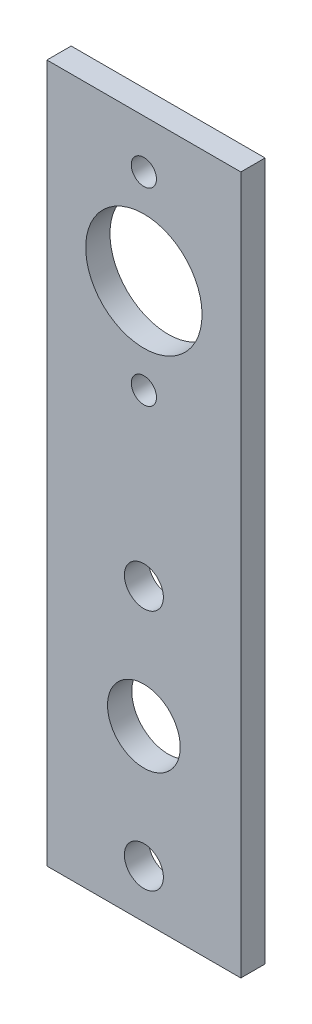
ISO-10303-21;
HEADER;
FILE_DESCRIPTION(('STEP AP214'),'2;1');
FILE_NAME('part.step','',(''),(''),'','','');
FILE_SCHEMA(('AUTOMOTIVE_DESIGN { 1 0 10303 214 1 1 1 1 }'));
ENDSEC;
DATA;
#1=APPLICATION_CONTEXT('core data for automotive mechanical design processes');
#2=APPLICATION_PROTOCOL_DEFINITION('international standard','automotive_design',2000,#1);
#3=PRODUCT_CONTEXT('',#1,'mechanical');
#4=PRODUCT('Part','Part','',(#3));
#5=PRODUCT_RELATED_PRODUCT_CATEGORY('part','',(#4));
#6=PRODUCT_DEFINITION_FORMATION('','',#4);
#7=PRODUCT_DEFINITION_CONTEXT('part definition',#1,'design');
#8=PRODUCT_DEFINITION('design','',#6,#7);
#9=PRODUCT_DEFINITION_SHAPE('','',#8);
#10=(LENGTH_UNIT() NAMED_UNIT(*) SI_UNIT(.MILLI.,.METRE.));
#11=(NAMED_UNIT(*) PLANE_ANGLE_UNIT() SI_UNIT($,.RADIAN.));
#12=(NAMED_UNIT(*) SI_UNIT($,.STERADIAN.) SOLID_ANGLE_UNIT());
#13=UNCERTAINTY_MEASURE_WITH_UNIT(LENGTH_MEASURE(1.E-05),#10,'distance_accuracy_value','');
#14=(GEOMETRIC_REPRESENTATION_CONTEXT(3) GLOBAL_UNCERTAINTY_ASSIGNED_CONTEXT((#13)) GLOBAL_UNIT_ASSIGNED_CONTEXT((#10,
#11,#12)) REPRESENTATION_CONTEXT('',''));
#15=CARTESIAN_POINT('',(0.,0.,0.));
#16=DIRECTION('',(0.,0.,1.));
#17=DIRECTION('',(1.,0.,0.));
#18=AXIS2_PLACEMENT_3D('',#15,#16,#17);
#19=CARTESIAN_POINT('',(0.,0.,3.175));
#20=DIRECTION('',(1.,0.,0.));
#21=DIRECTION('',(0.,0.,-1.));
#22=AXIS2_PLACEMENT_3D('',#19,#20,#21);
#23=PLANE('',#22);
#24=DIRECTION('',(0.,-1.,0.));
#25=VECTOR('',#24,1.);
#26=CARTESIAN_POINT('',(0.,0.,0.));
#27=LINE('',#26,#25);
#28=CARTESIAN_POINT('',(0.,91.44,0.));
#29=VERTEX_POINT('',#28);
#30=CARTESIAN_POINT('',(0.,0.,0.));
#31=VERTEX_POINT('',#30);
#32=EDGE_CURVE('E96',#29,#31,#27,.T.);
#33=ORIENTED_EDGE('',*,*,#32,.T.);
#34=DIRECTION('',(0.,0.,-1.));
#35=VECTOR('',#34,1.);
#36=CARTESIAN_POINT('',(0.,0.,3.175));
#37=LINE('',#36,#35);
#38=CARTESIAN_POINT('',(0.,0.,3.175));
#39=VERTEX_POINT('',#38);
#40=EDGE_CURVE('E11',#39,#31,#37,.T.);
#41=ORIENTED_EDGE('',*,*,#40,.F.);
#42=DIRECTION('',(0.,-1.,0.));
#43=VECTOR('',#42,1.);
#44=CARTESIAN_POINT('',(0.,0.,3.175));
#45=LINE('',#44,#43);
#46=CARTESIAN_POINT('',(0.,91.44,3.175));
#47=VERTEX_POINT('',#46);
#48=EDGE_CURVE('E84',#47,#39,#45,.T.);
#49=ORIENTED_EDGE('',*,*,#48,.F.);
#50=DIRECTION('',(0.,0.,-1.));
#51=VECTOR('',#50,1.);
#52=CARTESIAN_POINT('',(0.,91.44,3.175));
#53=LINE('',#52,#51);
#54=EDGE_CURVE('E92',#47,#29,#53,.T.);
#55=ORIENTED_EDGE('',*,*,#54,.T.);
#56=EDGE_LOOP('',(#33,#41,#49,#55));
#57=FACE_BOUND('',#56,.T.);
#58=ADVANCED_FACE('F33',(#57),#23,.F.);
#59=CARTESIAN_POINT('',(0.,0.,3.175));
#60=DIRECTION('',(0.,1.,0.));
#61=DIRECTION('',(0.,0.,1.));
#62=AXIS2_PLACEMENT_3D('',#59,#60,#61);
#63=PLANE('',#62);
#64=DIRECTION('',(1.,0.,0.));
#65=VECTOR('',#64,1.);
#66=CARTESIAN_POINT('',(0.,0.,0.));
#67=LINE('',#66,#65);
#68=CARTESIAN_POINT('',(25.4,0.,0.));
#69=VERTEX_POINT('',#68);
#70=EDGE_CURVE('E88',#31,#69,#67,.T.);
#71=ORIENTED_EDGE('',*,*,#70,.T.);
#72=DIRECTION('',(0.,0.,-1.));
#73=VECTOR('',#72,1.);
#74=CARTESIAN_POINT('',(25.4,0.,3.175));
#75=LINE('',#74,#73);
#76=CARTESIAN_POINT('',(25.4,0.,3.175));
#77=VERTEX_POINT('',#76);
#78=EDGE_CURVE('E41',#77,#69,#75,.T.);
#79=ORIENTED_EDGE('',*,*,#78,.F.);
#80=DIRECTION('',(1.,0.,0.));
#81=VECTOR('',#80,1.);
#82=CARTESIAN_POINT('',(0.,0.,3.175));
#83=LINE('',#82,#81);
#84=EDGE_CURVE('E79',#39,#77,#83,.T.);
#85=ORIENTED_EDGE('',*,*,#84,.F.);
#86=ORIENTED_EDGE('',*,*,#40,.T.);
#87=EDGE_LOOP('',(#71,#79,#85,#86));
#88=FACE_BOUND('',#87,.T.);
#89=ADVANCED_FACE('F87',(#88),#63,.F.);
#90=CARTESIAN_POINT('',(25.4,0.,3.175));
#91=DIRECTION('',(-1.,0.,0.));
#92=DIRECTION('',(0.,0.,1.));
#93=AXIS2_PLACEMENT_3D('',#90,#91,#92);
#94=PLANE('',#93);
#95=DIRECTION('',(0.,1.,0.));
#96=VECTOR('',#95,1.);
#97=CARTESIAN_POINT('',(25.4,0.,0.));
#98=LINE('',#97,#96);
#99=CARTESIAN_POINT('',(25.4,91.44,0.));
#100=VERTEX_POINT('',#99);
#101=EDGE_CURVE('E66',#69,#100,#98,.T.);
#102=ORIENTED_EDGE('',*,*,#101,.T.);
#103=DIRECTION('',(0.,0.,-1.));
#104=VECTOR('',#103,1.);
#105=CARTESIAN_POINT('',(25.4,91.44,3.175));
#106=LINE('',#105,#104);
#107=CARTESIAN_POINT('',(25.4,91.44,3.175));
#108=VERTEX_POINT('',#107);
#109=EDGE_CURVE('E89',#108,#100,#106,.T.);
#110=ORIENTED_EDGE('',*,*,#109,.F.);
#111=DIRECTION('',(0.,1.,0.));
#112=VECTOR('',#111,1.);
#113=CARTESIAN_POINT('',(25.4,0.,3.175));
#114=LINE('',#113,#112);
#115=EDGE_CURVE('E82',#77,#108,#114,.T.);
#116=ORIENTED_EDGE('',*,*,#115,.F.);
#117=ORIENTED_EDGE('',*,*,#78,.T.);
#118=EDGE_LOOP('',(#102,#110,#116,#117));
#119=FACE_BOUND('',#118,.T.);
#120=ADVANCED_FACE('F90',(#119),#94,.F.);
#121=CARTESIAN_POINT('',(0.,91.44,3.175));
#122=DIRECTION('',(0.,-1.,0.));
#123=DIRECTION('',(0.,0.,-1.));
#124=AXIS2_PLACEMENT_3D('',#121,#122,#123);
#125=PLANE('',#124);
#126=DIRECTION('',(-1.,0.,0.));
#127=VECTOR('',#126,1.);
#128=CARTESIAN_POINT('',(0.,91.44,0.));
#129=LINE('',#128,#127);
#130=EDGE_CURVE('E72',#100,#29,#129,.T.);
#131=ORIENTED_EDGE('',*,*,#130,.T.);
#132=ORIENTED_EDGE('',*,*,#54,.F.);
#133=DIRECTION('',(-1.,0.,0.));
#134=VECTOR('',#133,1.);
#135=CARTESIAN_POINT('',(0.,91.44,3.175));
#136=LINE('',#135,#134);
#137=EDGE_CURVE('E49',#108,#47,#136,.T.);
#138=ORIENTED_EDGE('',*,*,#137,.F.);
#139=ORIENTED_EDGE('',*,*,#109,.T.);
#140=EDGE_LOOP('',(#131,#132,#138,#139));
#141=FACE_BOUND('',#140,.T.);
#142=ADVANCED_FACE('F104',(#141),#125,.F.);
#143=CARTESIAN_POINT('',(0.,0.,3.175));
#144=DIRECTION('',(0.,0.,-1.));
#145=DIRECTION('',(-1.,0.,0.));
#146=AXIS2_PLACEMENT_3D('',#143,#144,#145);
#147=PLANE('',#146);
#148=CARTESIAN_POINT('',(12.7,72.7075,3.175));
#149=DIRECTION('',(0.,0.,1.));
#150=DIRECTION('',(1.,0.,0.));
#151=AXIS2_PLACEMENT_3D('',#148,#149,#150);
#152=CIRCLE('',#151,7.61999999999999);
#153=CARTESIAN_POINT('',(20.32,72.7075,3.175));
#154=VERTEX_POINT('',#153);
#155=EDGE_CURVE('E137',#154,#154,#152,.T.);
#156=ORIENTED_EDGE('',*,*,#155,.F.);
#157=EDGE_LOOP('',(#156));
#158=FACE_BOUND('',#157,.T.);
#159=CARTESIAN_POINT('',(12.7,60.325,3.175));
#160=DIRECTION('',(0.,0.,1.));
#161=DIRECTION('',(1.,0.,0.));
#162=AXIS2_PLACEMENT_3D('',#159,#160,#161);
#163=CIRCLE('',#162,1.65099999999999);
#164=CARTESIAN_POINT('',(14.351,60.325,3.175));
#165=VERTEX_POINT('',#164);
#166=EDGE_CURVE('E131',#165,#165,#163,.T.);
#167=ORIENTED_EDGE('',*,*,#166,.F.);
#168=EDGE_LOOP('',(#167));
#169=FACE_BOUND('',#168,.T.);
#170=CARTESIAN_POINT('',(12.7,85.09,3.175));
#171=DIRECTION('',(0.,0.,1.));
#172=DIRECTION('',(1.,0.,0.));
#173=AXIS2_PLACEMENT_3D('',#170,#171,#172);
#174=CIRCLE('',#173,1.65099999999999);
#175=CARTESIAN_POINT('',(14.351,85.09,3.175));
#176=VERTEX_POINT('',#175);
#177=EDGE_CURVE('E128',#176,#176,#174,.T.);
#178=ORIENTED_EDGE('',*,*,#177,.F.);
#179=EDGE_LOOP('',(#178));
#180=FACE_BOUND('',#179,.T.);
#181=CARTESIAN_POINT('',(12.7,22.225,3.175));
#182=DIRECTION('',(0.,0.,1.));
#183=DIRECTION('',(1.,0.,0.));
#184=AXIS2_PLACEMENT_3D('',#181,#182,#183);
#185=CIRCLE('',#184,4.7625);
#186=CARTESIAN_POINT('',(17.4625,22.225,3.175));
#187=VERTEX_POINT('',#186);
#188=EDGE_CURVE('E122',#187,#187,#185,.T.);
#189=ORIENTED_EDGE('',*,*,#188,.F.);
#190=EDGE_LOOP('',(#189));
#191=FACE_BOUND('',#190,.T.);
#192=CARTESIAN_POINT('',(12.7,38.1,3.175));
#193=DIRECTION('',(0.,0.,1.));
#194=DIRECTION('',(1.,0.,0.));
#195=AXIS2_PLACEMENT_3D('',#192,#193,#194);
#196=CIRCLE('',#195,2.5527);
#197=CARTESIAN_POINT('',(15.2527,38.1,3.175));
#198=VERTEX_POINT('',#197);
#199=EDGE_CURVE('E116',#198,#198,#196,.T.);
#200=ORIENTED_EDGE('',*,*,#199,.F.);
#201=EDGE_LOOP('',(#200));
#202=FACE_BOUND('',#201,.T.);
#203=CARTESIAN_POINT('',(12.7,6.35,3.175));
#204=DIRECTION('',(0.,0.,1.));
#205=DIRECTION('',(1.,0.,0.));
#206=AXIS2_PLACEMENT_3D('',#203,#204,#205);
#207=CIRCLE('',#206,2.5527);
#208=CARTESIAN_POINT('',(15.2527,6.35,3.175));
#209=VERTEX_POINT('',#208);
#210=EDGE_CURVE('E110',#209,#209,#207,.T.);
#211=ORIENTED_EDGE('',*,*,#210,.F.);
#212=EDGE_LOOP('',(#211));
#213=FACE_BOUND('',#212,.T.);
#214=ORIENTED_EDGE('',*,*,#48,.T.);
#215=ORIENTED_EDGE('',*,*,#84,.T.);
#216=ORIENTED_EDGE('',*,*,#115,.T.);
#217=ORIENTED_EDGE('',*,*,#137,.T.);
#218=EDGE_LOOP('',(#214,#215,#216,#217));
#219=FACE_BOUND('',#218,.T.);
#220=ADVANCED_FACE('F80',(#158,#169,#180,#191,#202,#213,#219),#147,.F.);
#221=CARTESIAN_POINT('',(0.,0.,0.));
#222=DIRECTION('',(0.,0.,-1.));
#223=DIRECTION('',(-1.,0.,0.));
#224=AXIS2_PLACEMENT_3D('',#221,#222,#223);
#225=PLANE('',#224);
#226=CARTESIAN_POINT('',(12.7,72.7075,0.));
#227=DIRECTION('',(0.,0.,1.));
#228=DIRECTION('',(1.,0.,0.));
#229=AXIS2_PLACEMENT_3D('',#226,#227,#228);
#230=CIRCLE('',#229,7.61999999999999);
#231=CARTESIAN_POINT('',(20.32,72.7075,0.));
#232=VERTEX_POINT('',#231);
#233=EDGE_CURVE('E140',#232,#232,#230,.T.);
#234=ORIENTED_EDGE('',*,*,#233,.T.);
#235=EDGE_LOOP('',(#234));
#236=FACE_BOUND('',#235,.T.);
#237=CARTESIAN_POINT('',(12.7,60.325,0.));
#238=DIRECTION('',(0.,0.,1.));
#239=DIRECTION('',(1.,0.,0.));
#240=AXIS2_PLACEMENT_3D('',#237,#238,#239);
#241=CIRCLE('',#240,1.65099999999999);
#242=CARTESIAN_POINT('',(14.351,60.325,0.));
#243=VERTEX_POINT('',#242);
#244=EDGE_CURVE('E134',#243,#243,#241,.T.);
#245=ORIENTED_EDGE('',*,*,#244,.T.);
#246=EDGE_LOOP('',(#245));
#247=FACE_BOUND('',#246,.T.);
#248=CARTESIAN_POINT('',(12.7,85.09,0.));
#249=DIRECTION('',(0.,0.,1.));
#250=DIRECTION('',(1.,0.,0.));
#251=AXIS2_PLACEMENT_3D('',#248,#249,#250);
#252=CIRCLE('',#251,1.65099999999999);
#253=CARTESIAN_POINT('',(14.351,85.09,0.));
#254=VERTEX_POINT('',#253);
#255=EDGE_CURVE('E125',#254,#254,#252,.T.);
#256=ORIENTED_EDGE('',*,*,#255,.T.);
#257=EDGE_LOOP('',(#256));
#258=FACE_BOUND('',#257,.T.);
#259=CARTESIAN_POINT('',(12.7,22.225,0.));
#260=DIRECTION('',(0.,0.,1.));
#261=DIRECTION('',(1.,0.,0.));
#262=AXIS2_PLACEMENT_3D('',#259,#260,#261);
#263=CIRCLE('',#262,4.7625);
#264=CARTESIAN_POINT('',(17.4625,22.225,0.));
#265=VERTEX_POINT('',#264);
#266=EDGE_CURVE('E119',#265,#265,#263,.T.);
#267=ORIENTED_EDGE('',*,*,#266,.T.);
#268=EDGE_LOOP('',(#267));
#269=FACE_BOUND('',#268,.T.);
#270=CARTESIAN_POINT('',(12.7,38.1,0.));
#271=DIRECTION('',(0.,0.,1.));
#272=DIRECTION('',(1.,0.,0.));
#273=AXIS2_PLACEMENT_3D('',#270,#271,#272);
#274=CIRCLE('',#273,2.5527);
#275=CARTESIAN_POINT('',(15.2527,38.1,0.));
#276=VERTEX_POINT('',#275);
#277=EDGE_CURVE('E113',#276,#276,#274,.T.);
#278=ORIENTED_EDGE('',*,*,#277,.T.);
#279=EDGE_LOOP('',(#278));
#280=FACE_BOUND('',#279,.T.);
#281=CARTESIAN_POINT('',(12.7,6.35,0.));
#282=DIRECTION('',(0.,0.,1.));
#283=DIRECTION('',(1.,0.,0.));
#284=AXIS2_PLACEMENT_3D('',#281,#282,#283);
#285=CIRCLE('',#284,2.5527);
#286=CARTESIAN_POINT('',(15.2527,6.35,0.));
#287=VERTEX_POINT('',#286);
#288=EDGE_CURVE('E99',#287,#287,#285,.T.);
#289=ORIENTED_EDGE('',*,*,#288,.T.);
#290=EDGE_LOOP('',(#289));
#291=FACE_BOUND('',#290,.T.);
#292=ORIENTED_EDGE('',*,*,#32,.F.);
#293=ORIENTED_EDGE('',*,*,#130,.F.);
#294=ORIENTED_EDGE('',*,*,#101,.F.);
#295=ORIENTED_EDGE('',*,*,#70,.F.);
#296=EDGE_LOOP('',(#292,#293,#294,#295));
#297=FACE_BOUND('',#296,.T.);
#298=ADVANCED_FACE('F107',(#236,#247,#258,#269,#280,#291,#297),#225,.T.);
#299=CARTESIAN_POINT('',(12.7,6.35,0.));
#300=DIRECTION('',(0.,0.,1.));
#301=DIRECTION('',(1.,0.,0.));
#302=AXIS2_PLACEMENT_3D('',#299,#300,#301);
#303=CYLINDRICAL_SURFACE('',#302,2.5527);
#304=ORIENTED_EDGE('',*,*,#288,.F.);
#305=EDGE_LOOP('',(#304));
#306=FACE_BOUND('',#305,.T.);
#307=ORIENTED_EDGE('',*,*,#210,.T.);
#308=EDGE_LOOP('',(#307));
#309=FACE_BOUND('',#308,.T.);
#310=ADVANCED_FACE('F161',(#306,#309),#303,.F.);
#311=CARTESIAN_POINT('',(12.7,38.1,0.));
#312=DIRECTION('',(0.,0.,1.));
#313=DIRECTION('',(1.,0.,0.));
#314=AXIS2_PLACEMENT_3D('',#311,#312,#313);
#315=CYLINDRICAL_SURFACE('',#314,2.5527);
#316=ORIENTED_EDGE('',*,*,#277,.F.);
#317=EDGE_LOOP('',(#316));
#318=FACE_BOUND('',#317,.T.);
#319=ORIENTED_EDGE('',*,*,#199,.T.);
#320=EDGE_LOOP('',(#319));
#321=FACE_BOUND('',#320,.T.);
#322=ADVANCED_FACE('F163',(#318,#321),#315,.F.);
#323=CARTESIAN_POINT('',(12.7,22.225,0.));
#324=DIRECTION('',(0.,0.,1.));
#325=DIRECTION('',(1.,0.,0.));
#326=AXIS2_PLACEMENT_3D('',#323,#324,#325);
#327=CYLINDRICAL_SURFACE('',#326,4.7625);
#328=ORIENTED_EDGE('',*,*,#266,.F.);
#329=EDGE_LOOP('',(#328));
#330=FACE_BOUND('',#329,.T.);
#331=ORIENTED_EDGE('',*,*,#188,.T.);
#332=EDGE_LOOP('',(#331));
#333=FACE_BOUND('',#332,.T.);
#334=ADVANCED_FACE('F170',(#330,#333),#327,.F.);
#335=CARTESIAN_POINT('',(12.7,85.09,0.));
#336=DIRECTION('',(0.,0.,1.));
#337=DIRECTION('',(1.,0.,0.));
#338=AXIS2_PLACEMENT_3D('',#335,#336,#337);
#339=CYLINDRICAL_SURFACE('',#338,1.65099999999999);
#340=ORIENTED_EDGE('',*,*,#255,.F.);
#341=EDGE_LOOP('',(#340));
#342=FACE_BOUND('',#341,.T.);
#343=ORIENTED_EDGE('',*,*,#177,.T.);
#344=EDGE_LOOP('',(#343));
#345=FACE_BOUND('',#344,.T.);
#346=ADVANCED_FACE('F205',(#342,#345),#339,.F.);
#347=CARTESIAN_POINT('',(12.7,60.325,0.));
#348=DIRECTION('',(0.,0.,1.));
#349=DIRECTION('',(1.,0.,0.));
#350=AXIS2_PLACEMENT_3D('',#347,#348,#349);
#351=CYLINDRICAL_SURFACE('',#350,1.65099999999999);
#352=ORIENTED_EDGE('',*,*,#244,.F.);
#353=EDGE_LOOP('',(#352));
#354=FACE_BOUND('',#353,.T.);
#355=ORIENTED_EDGE('',*,*,#166,.T.);
#356=EDGE_LOOP('',(#355));
#357=FACE_BOUND('',#356,.T.);
#358=ADVANCED_FACE('F210',(#354,#357),#351,.F.);
#359=CARTESIAN_POINT('',(12.7,72.7075,0.));
#360=DIRECTION('',(0.,0.,1.));
#361=DIRECTION('',(1.,0.,0.));
#362=AXIS2_PLACEMENT_3D('',#359,#360,#361);
#363=CYLINDRICAL_SURFACE('',#362,7.61999999999999);
#364=ORIENTED_EDGE('',*,*,#233,.F.);
#365=EDGE_LOOP('',(#364));
#366=FACE_BOUND('',#365,.T.);
#367=ORIENTED_EDGE('',*,*,#155,.T.);
#368=EDGE_LOOP('',(#367));
#369=FACE_BOUND('',#368,.T.);
#370=ADVANCED_FACE('F146',(#366,#369),#363,.F.);
#371=CLOSED_SHELL('',(#58,#89,#120,#142,#220,#298,#310,#322,#334,#346,#358,#370));
#372=MANIFOLD_SOLID_BREP('B2',#371);
#373=ADVANCED_BREP_SHAPE_REPRESENTATION('',(#18,#372),#14);
#374=SHAPE_DEFINITION_REPRESENTATION(#9,#373);
ENDSEC;
END-ISO-10303-21;
